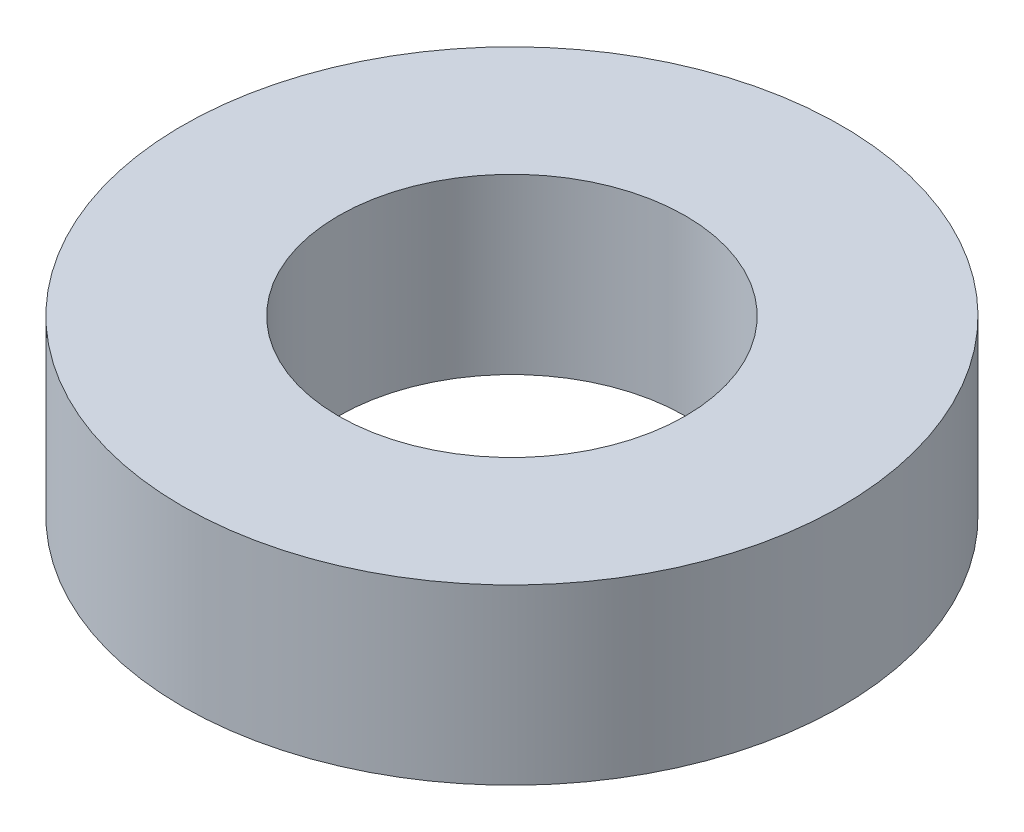
ISO-10303-21;
HEADER;
FILE_DESCRIPTION(('STEP AP214'),'2;1');
FILE_NAME('part.step','',(''),(''),'','','');
FILE_SCHEMA(('AUTOMOTIVE_DESIGN { 1 0 10303 214 1 1 1 1 }'));
ENDSEC;
DATA;
#1=APPLICATION_CONTEXT('core data for automotive mechanical design processes');
#2=APPLICATION_PROTOCOL_DEFINITION('international standard','automotive_design',2000,#1);
#3=PRODUCT_CONTEXT('',#1,'mechanical');
#4=PRODUCT('Part','Part','',(#3));
#5=PRODUCT_RELATED_PRODUCT_CATEGORY('part','',(#4));
#6=PRODUCT_DEFINITION_FORMATION('','',#4);
#7=PRODUCT_DEFINITION_CONTEXT('part definition',#1,'design');
#8=PRODUCT_DEFINITION('design','',#6,#7);
#9=PRODUCT_DEFINITION_SHAPE('','',#8);
#10=(LENGTH_UNIT() NAMED_UNIT(*) SI_UNIT(.MILLI.,.METRE.));
#11=(NAMED_UNIT(*) PLANE_ANGLE_UNIT() SI_UNIT($,.RADIAN.));
#12=(NAMED_UNIT(*) SI_UNIT($,.STERADIAN.) SOLID_ANGLE_UNIT());
#13=UNCERTAINTY_MEASURE_WITH_UNIT(LENGTH_MEASURE(1.E-05),#10,'distance_accuracy_value','');
#14=(GEOMETRIC_REPRESENTATION_CONTEXT(3) GLOBAL_UNCERTAINTY_ASSIGNED_CONTEXT((#13)) GLOBAL_UNIT_ASSIGNED_CONTEXT((#10,
#11,#12)) REPRESENTATION_CONTEXT('',''));
#15=CARTESIAN_POINT('',(0.,0.,0.));
#16=DIRECTION('',(0.,0.,1.));
#17=DIRECTION('',(1.,0.,0.));
#18=AXIS2_PLACEMENT_3D('',#15,#16,#17);
#19=CARTESIAN_POINT('',(0.,5.,0.));
#20=DIRECTION('',(0.,1.,0.));
#21=DIRECTION('',(0.,0.,1.));
#22=AXIS2_PLACEMENT_3D('',#19,#20,#21);
#23=PLANE('',#22);
#24=CARTESIAN_POINT('',(0.,5.,0.));
#25=DIRECTION('',(0.,1.,0.));
#26=DIRECTION('',(0.,0.,1.));
#27=AXIS2_PLACEMENT_3D('',#24,#25,#26);
#28=CIRCLE('',#27,9.5);
#29=CARTESIAN_POINT('',(0.,5.,9.5));
#30=VERTEX_POINT('',#29);
#31=EDGE_CURVE('E10',#30,#30,#28,.T.);
#32=ORIENTED_EDGE('',*,*,#31,.T.);
#33=EDGE_LOOP('',(#32));
#34=FACE_BOUND('',#33,.T.);
#35=CARTESIAN_POINT('',(0.,5.,0.));
#36=DIRECTION('',(0.,1.,0.));
#37=DIRECTION('',(0.,0.,1.));
#38=AXIS2_PLACEMENT_3D('',#35,#36,#37);
#39=CIRCLE('',#38,5.);
#40=CARTESIAN_POINT('',(0.,5.,5.));
#41=VERTEX_POINT('',#40);
#42=EDGE_CURVE('E51',#41,#41,#39,.T.);
#43=ORIENTED_EDGE('',*,*,#42,.F.);
#44=EDGE_LOOP('',(#43));
#45=FACE_BOUND('',#44,.T.);
#46=ADVANCED_FACE('F36',(#34,#45),#23,.T.);
#47=CARTESIAN_POINT('',(0.,0.,0.));
#48=DIRECTION('',(0.,1.,0.));
#49=DIRECTION('',(0.,0.,1.));
#50=AXIS2_PLACEMENT_3D('',#47,#48,#49);
#51=PLANE('',#50);
#52=CARTESIAN_POINT('',(0.,0.,0.));
#53=DIRECTION('',(0.,1.,0.));
#54=DIRECTION('',(0.,0.,1.));
#55=AXIS2_PLACEMENT_3D('',#52,#53,#54);
#56=CIRCLE('',#55,9.5);
#57=CARTESIAN_POINT('',(0.,0.,9.5));
#58=VERTEX_POINT('',#57);
#59=EDGE_CURVE('E40',#58,#58,#56,.T.);
#60=ORIENTED_EDGE('',*,*,#59,.F.);
#61=EDGE_LOOP('',(#60));
#62=FACE_BOUND('',#61,.T.);
#63=CARTESIAN_POINT('',(0.,0.,0.));
#64=DIRECTION('',(0.,1.,0.));
#65=DIRECTION('',(0.,0.,1.));
#66=AXIS2_PLACEMENT_3D('',#63,#64,#65);
#67=CIRCLE('',#66,5.);
#68=CARTESIAN_POINT('',(0.,0.,5.));
#69=VERTEX_POINT('',#68);
#70=EDGE_CURVE('E53',#69,#69,#67,.T.);
#71=ORIENTED_EDGE('',*,*,#70,.T.);
#72=EDGE_LOOP('',(#71));
#73=FACE_BOUND('',#72,.T.);
#74=ADVANCED_FACE('F63',(#62,#73),#51,.F.);
#75=CARTESIAN_POINT('',(0.,5.,0.));
#76=DIRECTION('',(0.,-1.,0.));
#77=DIRECTION('',(0.,0.,-1.));
#78=AXIS2_PLACEMENT_3D('',#75,#76,#77);
#79=CYLINDRICAL_SURFACE('',#78,9.5);
#80=ORIENTED_EDGE('',*,*,#31,.F.);
#81=EDGE_LOOP('',(#80));
#82=FACE_BOUND('',#81,.T.);
#83=ORIENTED_EDGE('',*,*,#59,.T.);
#84=EDGE_LOOP('',(#83));
#85=FACE_BOUND('',#84,.T.);
#86=ADVANCED_FACE('F38',(#82,#85),#79,.T.);
#87=CARTESIAN_POINT('',(0.,5.,0.));
#88=DIRECTION('',(0.,-1.,0.));
#89=DIRECTION('',(0.,0.,-1.));
#90=AXIS2_PLACEMENT_3D('',#87,#88,#89);
#91=CYLINDRICAL_SURFACE('',#90,5.);
#92=ORIENTED_EDGE('',*,*,#42,.T.);
#93=EDGE_LOOP('',(#92));
#94=FACE_BOUND('',#93,.T.);
#95=ORIENTED_EDGE('',*,*,#70,.F.);
#96=EDGE_LOOP('',(#95));
#97=FACE_BOUND('',#96,.T.);
#98=ADVANCED_FACE('F59',(#94,#97),#91,.F.);
#99=CLOSED_SHELL('',(#46,#74,#86,#98));
#100=MANIFOLD_SOLID_BREP('B2',#99);
#101=ADVANCED_BREP_SHAPE_REPRESENTATION('',(#18,#100),#14);
#102=SHAPE_DEFINITION_REPRESENTATION(#9,#101);
ENDSEC;
END-ISO-10303-21;
